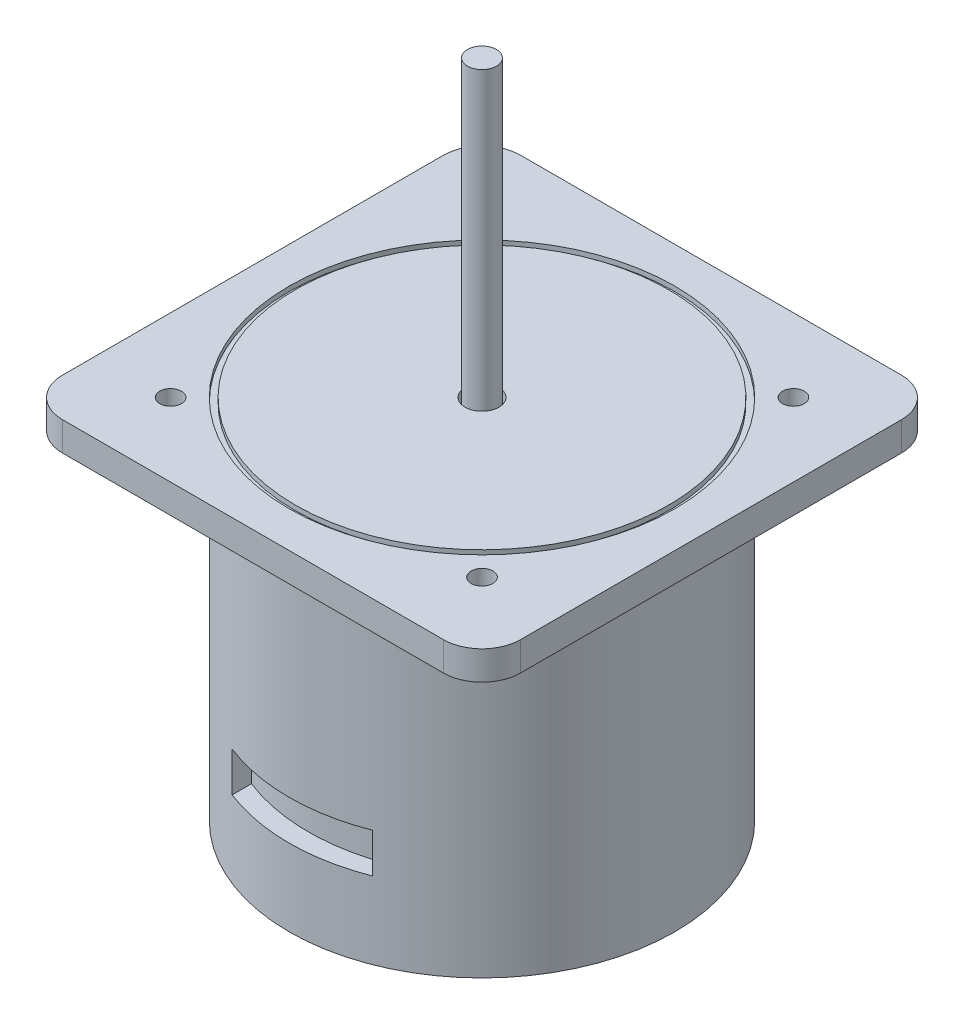
ISO-10303-21;
HEADER;
FILE_DESCRIPTION(('STEP AP214'),'2;1');
FILE_NAME('part.step','',(''),(''),'','','');
FILE_SCHEMA(('AUTOMOTIVE_DESIGN { 1 0 10303 214 1 1 1 1 }'));
ENDSEC;
DATA;
#1=APPLICATION_CONTEXT('core data for automotive mechanical design processes');
#2=APPLICATION_PROTOCOL_DEFINITION('international standard','automotive_design',2000,#1);
#3=PRODUCT_CONTEXT('',#1,'mechanical');
#4=PRODUCT('Part','Part','',(#3));
#5=PRODUCT_RELATED_PRODUCT_CATEGORY('part','',(#4));
#6=PRODUCT_DEFINITION_FORMATION('','',#4);
#7=PRODUCT_DEFINITION_CONTEXT('part definition',#1,'design');
#8=PRODUCT_DEFINITION('design','',#6,#7);
#9=PRODUCT_DEFINITION_SHAPE('','',#8);
#10=(LENGTH_UNIT() NAMED_UNIT(*) SI_UNIT(.MILLI.,.METRE.));
#11=(NAMED_UNIT(*) PLANE_ANGLE_UNIT() SI_UNIT($,.RADIAN.));
#12=(NAMED_UNIT(*) SI_UNIT($,.STERADIAN.) SOLID_ANGLE_UNIT());
#13=UNCERTAINTY_MEASURE_WITH_UNIT(LENGTH_MEASURE(1.E-05),#10,'distance_accuracy_value','');
#14=(GEOMETRIC_REPRESENTATION_CONTEXT(3) GLOBAL_UNCERTAINTY_ASSIGNED_CONTEXT((#13)) GLOBAL_UNIT_ASSIGNED_CONTEXT((#10,
#11,#12)) REPRESENTATION_CONTEXT('',''));
#15=CARTESIAN_POINT('',(0.,0.,0.));
#16=DIRECTION('',(0.,0.,1.));
#17=DIRECTION('',(1.,0.,0.));
#18=AXIS2_PLACEMENT_3D('',#15,#16,#17);
#19=CARTESIAN_POINT('',(0.,0.,0.));
#20=DIRECTION('',(0.,1.,0.));
#21=DIRECTION('',(0.,0.,1.));
#22=AXIS2_PLACEMENT_3D('',#19,#20,#21);
#23=PLANE('',#22);
#24=CARTESIAN_POINT('',(22.4964510362882,0.,0.));
#25=DIRECTION('',(0.,1.,0.));
#26=DIRECTION('',(0.,0.,-1.));
#27=AXIS2_PLACEMENT_3D('',#24,#25,#26);
#28=CIRCLE('',#27,5.38478881187688);
#29=CARTESIAN_POINT('',(25.6226762505398,0.,-4.38436614099365));
#30=VERTEX_POINT('',#29);
#31=CARTESIAN_POINT('',(25.77290034815,0.,4.27326929356368));
#32=VERTEX_POINT('',#31);
#33=EDGE_CURVE('E205',#30,#32,#28,.F.);
#34=ORIENTED_EDGE('',*,*,#33,.T.);
#35=DIRECTION('',(0.608463846276613,0.,0.793581594906454));
#36=VECTOR('',#35,1.);
#37=CARTESIAN_POINT('',(14.1676292878415,0.,-10.862764792469));
#38=LINE('',#37,#36);
#39=CARTESIAN_POINT('',(27.3190931834106,0.,6.28987255396704));
#40=VERTEX_POINT('',#39);
#41=EDGE_CURVE('E179',#32,#40,#38,.T.);
#42=ORIENTED_EDGE('',*,*,#41,.T.);
#43=CARTESIAN_POINT('',(22.4964510362882,0.,0.));
#44=DIRECTION('',(0.,1.,0.));
#45=DIRECTION('',(0.,0.,-1.));
#46=AXIS2_PLACEMENT_3D('',#43,#44,#45);
#47=CIRCLE('',#46,7.92593048318929);
#48=CARTESIAN_POINT('',(27.0979766649814,0.,-6.45339723810865));
#49=VERTEX_POINT('',#48);
#50=EDGE_CURVE('E193',#40,#49,#47,.T.);
#51=ORIENTED_EDGE('',*,*,#50,.T.);
#52=DIRECTION('',(0.58056598382398,0.,-0.814213202070867));
#53=VECTOR('',#52,1.);
#54=CARTESIAN_POINT('',(14.9138678534548,0.,10.634173384735));
#55=LINE('',#54,#53);
#56=EDGE_CURVE('E51',#30,#49,#55,.T.);
#57=ORIENTED_EDGE('',*,*,#56,.F.);
#58=EDGE_LOOP('',(#34,#42,#51,#57));
#59=FACE_BOUND('',#58,.T.);
#60=CARTESIAN_POINT('',(0.,0.,0.));
#61=DIRECTION('',(0.,1.,0.));
#62=DIRECTION('',(0.,0.,1.));
#63=AXIS2_PLACEMENT_3D('',#60,#61,#62);
#64=CIRCLE('',#63,40.);
#65=CARTESIAN_POINT('',(0.,0.,40.));
#66=VERTEX_POINT('',#65);
#67=EDGE_CURVE('E313',#66,#66,#64,.T.);
#68=ORIENTED_EDGE('',*,*,#67,.F.);
#69=EDGE_LOOP('',(#68));
#70=FACE_BOUND('',#69,.T.);
#71=DIRECTION('',(-0.608463846276613,0.,0.793581594906454));
#72=VECTOR('',#71,1.);
#73=CARTESIAN_POINT('',(-14.1676292878415,0.,-10.862764792469));
#74=LINE('',#73,#72);
#75=CARTESIAN_POINT('',(-25.77290034815,0.,4.27326929356368));
#76=VERTEX_POINT('',#75);
#77=CARTESIAN_POINT('',(-27.3190931834106,0.,6.28987255396704));
#78=VERTEX_POINT('',#77);
#79=EDGE_CURVE('E184',#76,#78,#74,.T.);
#80=ORIENTED_EDGE('',*,*,#79,.F.);
#81=CARTESIAN_POINT('',(-22.4964510362882,0.,0.));
#82=DIRECTION('',(0.,-1.,0.));
#83=DIRECTION('',(0.,0.,-1.));
#84=AXIS2_PLACEMENT_3D('',#81,#82,#83);
#85=CIRCLE('',#84,5.38478881187688);
#86=CARTESIAN_POINT('',(-25.6226762505398,0.,-4.38436614099365));
#87=VERTEX_POINT('',#86);
#88=EDGE_CURVE('E218',#87,#76,#85,.F.);
#89=ORIENTED_EDGE('',*,*,#88,.F.);
#90=DIRECTION('',(-0.58056598382398,0.,-0.814213202070867));
#91=VECTOR('',#90,1.);
#92=CARTESIAN_POINT('',(-14.9138678534548,0.,10.634173384735));
#93=LINE('',#92,#91);
#94=CARTESIAN_POINT('',(-27.0979766649814,0.,-6.45339723810865));
#95=VERTEX_POINT('',#94);
#96=EDGE_CURVE('E229',#87,#95,#93,.T.);
#97=ORIENTED_EDGE('',*,*,#96,.T.);
#98=CARTESIAN_POINT('',(-22.4964510362882,0.,0.));
#99=DIRECTION('',(0.,-1.,0.));
#100=DIRECTION('',(0.,0.,-1.));
#101=AXIS2_PLACEMENT_3D('',#98,#99,#100);
#102=CIRCLE('',#101,7.92593048318929);
#103=EDGE_CURVE('E59',#78,#95,#102,.T.);
#104=ORIENTED_EDGE('',*,*,#103,.F.);
#105=EDGE_LOOP('',(#80,#89,#97,#104));
#106=FACE_BOUND('',#105,.T.);
#107=ADVANCED_FACE('F34',(#59,#70,#106),#23,.F.);
#108=CARTESIAN_POINT('',(0.,70.,0.));
#109=DIRECTION('',(0.,-1.,0.));
#110=DIRECTION('',(0.,0.,-1.));
#111=AXIS2_PLACEMENT_3D('',#108,#109,#110);
#112=CYLINDRICAL_SURFACE('',#111,40.);
#113=ORIENTED_EDGE('',*,*,#67,.T.);
#114=EDGE_LOOP('',(#113));
#115=FACE_BOUND('',#114,.T.);
#116=CARTESIAN_POINT('',(0.,70.,0.));
#117=DIRECTION('',(0.,1.,0.));
#118=DIRECTION('',(0.,0.,1.));
#119=AXIS2_PLACEMENT_3D('',#116,#117,#118);
#120=CIRCLE('',#119,40.);
#121=CARTESIAN_POINT('',(0.,70.,40.));
#122=VERTEX_POINT('',#121);
#123=EDGE_CURVE('E324',#122,#122,#120,.T.);
#124=ORIENTED_EDGE('',*,*,#123,.F.);
#125=EDGE_LOOP('',(#124));
#126=FACE_BOUND('',#125,.T.);
#127=DIRECTION('',(0.,-1.,0.));
#128=VECTOR('',#127,1.);
#129=CARTESIAN_POINT('',(-14.5735687844263,70.,37.2506522477875));
#130=LINE('',#129,#128);
#131=CARTESIAN_POINT('',(-14.5735687844263,24.166302971847,37.2506522477875));
#132=VERTEX_POINT('',#131);
#133=CARTESIAN_POINT('',(-14.5735687844263,15.945315452427,37.2506522477875));
#134=VERTEX_POINT('',#133);
#135=EDGE_CURVE('E257',#132,#134,#130,.T.);
#136=ORIENTED_EDGE('',*,*,#135,.F.);
#137=CARTESIAN_POINT('',(0.,24.166302971847,0.));
#138=DIRECTION('',(0.,-1.,0.));
#139=DIRECTION('',(0.,0.,-1.));
#140=AXIS2_PLACEMENT_3D('',#137,#138,#139);
#141=CIRCLE('',#140,40.);
#142=CARTESIAN_POINT('',(14.5735687844263,24.166302971847,37.2506522477875));
#143=VERTEX_POINT('',#142);
#144=EDGE_CURVE('E253',#143,#132,#141,.T.);
#145=ORIENTED_EDGE('',*,*,#144,.F.);
#146=DIRECTION('',(0.,-1.,0.));
#147=VECTOR('',#146,1.);
#148=CARTESIAN_POINT('',(14.5735687844263,70.,37.2506522477875));
#149=LINE('',#148,#147);
#150=CARTESIAN_POINT('',(14.5735687844263,15.945315452427,37.2506522477875));
#151=VERTEX_POINT('',#150);
#152=EDGE_CURVE('E248',#143,#151,#149,.T.);
#153=ORIENTED_EDGE('',*,*,#152,.T.);
#154=CARTESIAN_POINT('',(0.,15.945315452427,0.));
#155=DIRECTION('',(0.,1.,0.));
#156=DIRECTION('',(0.,0.,1.));
#157=AXIS2_PLACEMENT_3D('',#154,#155,#156);
#158=CIRCLE('',#157,40.);
#159=EDGE_CURVE('E244',#134,#151,#158,.T.);
#160=ORIENTED_EDGE('',*,*,#159,.F.);
#161=EDGE_LOOP('',(#136,#145,#153,#160));
#162=FACE_BOUND('',#161,.T.);
#163=ADVANCED_FACE('F391',(#115,#126,#162),#112,.T.);
#164=CARTESIAN_POINT('',(47.5,76.,-47.5));
#165=DIRECTION('',(-1.,0.,0.));
#166=DIRECTION('',(0.,0.,1.));
#167=AXIS2_PLACEMENT_3D('',#164,#165,#166);
#168=PLANE('',#167);
#169=DIRECTION('',(0.,0.,-1.));
#170=VECTOR('',#169,1.);
#171=CARTESIAN_POINT('',(47.5,76.,-47.5));
#172=LINE('',#171,#170);
#173=CARTESIAN_POINT('',(47.5,76.,39.5));
#174=VERTEX_POINT('',#173);
#175=CARTESIAN_POINT('',(47.5,76.,-39.5));
#176=VERTEX_POINT('',#175);
#177=EDGE_CURVE('E300',#174,#176,#172,.T.);
#178=ORIENTED_EDGE('',*,*,#177,.F.);
#179=DIRECTION('',(0.,-1.,0.));
#180=VECTOR('',#179,1.);
#181=CARTESIAN_POINT('',(47.5,76.,39.5));
#182=LINE('',#181,#180);
#183=CARTESIAN_POINT('',(47.5,70.,39.5));
#184=VERTEX_POINT('',#183);
#185=EDGE_CURVE('E331',#174,#184,#182,.T.);
#186=ORIENTED_EDGE('',*,*,#185,.T.);
#187=DIRECTION('',(0.,0.,-1.));
#188=VECTOR('',#187,1.);
#189=CARTESIAN_POINT('',(47.5,70.,-47.5));
#190=LINE('',#189,#188);
#191=CARTESIAN_POINT('',(47.5,70.,-39.5));
#192=VERTEX_POINT('',#191);
#193=EDGE_CURVE('E297',#184,#192,#190,.T.);
#194=ORIENTED_EDGE('',*,*,#193,.T.);
#195=DIRECTION('',(0.,-1.,0.));
#196=VECTOR('',#195,1.);
#197=CARTESIAN_POINT('',(47.5,76.,-39.5));
#198=LINE('',#197,#196);
#199=EDGE_CURVE('E327',#192,#176,#198,.F.);
#200=ORIENTED_EDGE('',*,*,#199,.T.);
#201=EDGE_LOOP('',(#178,#186,#194,#200));
#202=FACE_BOUND('',#201,.T.);
#203=ADVANCED_FACE('F397',(#202),#168,.F.);
#204=CARTESIAN_POINT('',(-47.5,76.,-47.5));
#205=DIRECTION('',(0.,0.,1.));
#206=DIRECTION('',(1.,0.,0.));
#207=AXIS2_PLACEMENT_3D('',#204,#205,#206);
#208=PLANE('',#207);
#209=DIRECTION('',(-1.,0.,0.));
#210=VECTOR('',#209,1.);
#211=CARTESIAN_POINT('',(-47.5,70.,-47.5));
#212=LINE('',#211,#210);
#213=CARTESIAN_POINT('',(39.5,70.,-47.5));
#214=VERTEX_POINT('',#213);
#215=CARTESIAN_POINT('',(-39.5,70.,-47.5));
#216=VERTEX_POINT('',#215);
#217=EDGE_CURVE('E316',#214,#216,#212,.T.);
#218=ORIENTED_EDGE('',*,*,#217,.T.);
#219=DIRECTION('',(0.,-1.,0.));
#220=VECTOR('',#219,1.);
#221=CARTESIAN_POINT('',(-39.5,76.,-47.5));
#222=LINE('',#221,#220);
#223=CARTESIAN_POINT('',(-39.5,76.,-47.5));
#224=VERTEX_POINT('',#223);
#225=EDGE_CURVE('E11',#216,#224,#222,.F.);
#226=ORIENTED_EDGE('',*,*,#225,.T.);
#227=DIRECTION('',(-1.,0.,0.));
#228=VECTOR('',#227,1.);
#229=CARTESIAN_POINT('',(-47.5,76.,-47.5));
#230=LINE('',#229,#228);
#231=CARTESIAN_POINT('',(39.5,76.,-47.5));
#232=VERTEX_POINT('',#231);
#233=EDGE_CURVE('E303',#232,#224,#230,.T.);
#234=ORIENTED_EDGE('',*,*,#233,.F.);
#235=DIRECTION('',(0.,-1.,0.));
#236=VECTOR('',#235,1.);
#237=CARTESIAN_POINT('',(39.5,76.,-47.5));
#238=LINE('',#237,#236);
#239=EDGE_CURVE('E43',#232,#214,#238,.T.);
#240=ORIENTED_EDGE('',*,*,#239,.T.);
#241=EDGE_LOOP('',(#218,#226,#234,#240));
#242=FACE_BOUND('',#241,.T.);
#243=ADVANCED_FACE('F447',(#242),#208,.F.);
#244=CARTESIAN_POINT('',(-47.5,76.,-47.5));
#245=DIRECTION('',(1.,0.,0.));
#246=DIRECTION('',(0.,0.,-1.));
#247=AXIS2_PLACEMENT_3D('',#244,#245,#246);
#248=PLANE('',#247);
#249=DIRECTION('',(0.,0.,1.));
#250=VECTOR('',#249,1.);
#251=CARTESIAN_POINT('',(-47.5,70.,-47.5));
#252=LINE('',#251,#250);
#253=CARTESIAN_POINT('',(-47.5,70.,-39.5));
#254=VERTEX_POINT('',#253);
#255=CARTESIAN_POINT('',(-47.5,70.,39.5));
#256=VERTEX_POINT('',#255);
#257=EDGE_CURVE('E319',#254,#256,#252,.T.);
#258=ORIENTED_EDGE('',*,*,#257,.T.);
#259=DIRECTION('',(0.,-1.,0.));
#260=VECTOR('',#259,1.);
#261=CARTESIAN_POINT('',(-47.5,76.,39.5));
#262=LINE('',#261,#260);
#263=CARTESIAN_POINT('',(-47.5,76.,39.5));
#264=VERTEX_POINT('',#263);
#265=EDGE_CURVE('E358',#256,#264,#262,.F.);
#266=ORIENTED_EDGE('',*,*,#265,.T.);
#267=DIRECTION('',(0.,0.,1.));
#268=VECTOR('',#267,1.);
#269=CARTESIAN_POINT('',(-47.5,76.,-47.5));
#270=LINE('',#269,#268);
#271=CARTESIAN_POINT('',(-47.5,76.,-39.5));
#272=VERTEX_POINT('',#271);
#273=EDGE_CURVE('E307',#272,#264,#270,.T.);
#274=ORIENTED_EDGE('',*,*,#273,.F.);
#275=DIRECTION('',(0.,-1.,0.));
#276=VECTOR('',#275,1.);
#277=CARTESIAN_POINT('',(-47.5,76.,-39.5));
#278=LINE('',#277,#276);
#279=EDGE_CURVE('E355',#272,#254,#278,.T.);
#280=ORIENTED_EDGE('',*,*,#279,.T.);
#281=EDGE_LOOP('',(#258,#266,#274,#280));
#282=FACE_BOUND('',#281,.T.);
#283=ADVANCED_FACE('F429',(#282),#248,.F.);
#284=CARTESIAN_POINT('',(-47.5,76.,47.5));
#285=DIRECTION('',(0.,0.,-1.));
#286=DIRECTION('',(-1.,0.,0.));
#287=AXIS2_PLACEMENT_3D('',#284,#285,#286);
#288=PLANE('',#287);
#289=DIRECTION('',(1.,0.,0.));
#290=VECTOR('',#289,1.);
#291=CARTESIAN_POINT('',(-47.5,70.,47.5));
#292=LINE('',#291,#290);
#293=CARTESIAN_POINT('',(-39.5,70.,47.5));
#294=VERTEX_POINT('',#293);
#295=CARTESIAN_POINT('',(39.5,70.,47.5));
#296=VERTEX_POINT('',#295);
#297=EDGE_CURVE('E304',#294,#296,#292,.T.);
#298=ORIENTED_EDGE('',*,*,#297,.T.);
#299=DIRECTION('',(0.,-1.,0.));
#300=VECTOR('',#299,1.);
#301=CARTESIAN_POINT('',(39.5,76.,47.5));
#302=LINE('',#301,#300);
#303=CARTESIAN_POINT('',(39.5,76.,47.5));
#304=VERTEX_POINT('',#303);
#305=EDGE_CURVE('E345',#296,#304,#302,.F.);
#306=ORIENTED_EDGE('',*,*,#305,.T.);
#307=DIRECTION('',(1.,0.,0.));
#308=VECTOR('',#307,1.);
#309=CARTESIAN_POINT('',(-47.5,76.,47.5));
#310=LINE('',#309,#308);
#311=CARTESIAN_POINT('',(-39.5,76.,47.5));
#312=VERTEX_POINT('',#311);
#313=EDGE_CURVE('E310',#312,#304,#310,.T.);
#314=ORIENTED_EDGE('',*,*,#313,.F.);
#315=DIRECTION('',(0.,-1.,0.));
#316=VECTOR('',#315,1.);
#317=CARTESIAN_POINT('',(-39.5,76.,47.5));
#318=LINE('',#317,#316);
#319=EDGE_CURVE('E342',#312,#294,#318,.T.);
#320=ORIENTED_EDGE('',*,*,#319,.T.);
#321=EDGE_LOOP('',(#298,#306,#314,#320));
#322=FACE_BOUND('',#321,.T.);
#323=ADVANCED_FACE('F436',(#322),#288,.F.);
#324=CARTESIAN_POINT('',(0.,76.,0.));
#325=DIRECTION('',(0.,1.,0.));
#326=DIRECTION('',(0.,0.,1.));
#327=AXIS2_PLACEMENT_3D('',#324,#325,#326);
#328=PLANE('',#327);
#329=CARTESIAN_POINT('',(-32.2955996908533,76.,32.2955996908551));
#330=DIRECTION('',(0.,1.,0.));
#331=DIRECTION('',(0.,0.,1.));
#332=AXIS2_PLACEMENT_3D('',#329,#330,#331);
#333=CIRCLE('',#332,2.25);
#334=CARTESIAN_POINT('',(-32.2955996908533,76.,34.5455996908551));
#335=VERTEX_POINT('',#334);
#336=EDGE_CURVE('E702',#335,#335,#333,.T.);
#337=ORIENTED_EDGE('',*,*,#336,.F.);
#338=EDGE_LOOP('',(#337));
#339=FACE_BOUND('',#338,.T.);
#340=CARTESIAN_POINT('',(32.295599690857,76.,32.2955996908533));
#341=DIRECTION('',(0.,1.,0.));
#342=DIRECTION('',(0.,0.,1.));
#343=AXIS2_PLACEMENT_3D('',#340,#341,#342);
#344=CIRCLE('',#343,2.25);
#345=CARTESIAN_POINT('',(32.295599690857,76.,34.5455996908533));
#346=VERTEX_POINT('',#345);
#347=EDGE_CURVE('E698',#346,#346,#344,.T.);
#348=ORIENTED_EDGE('',*,*,#347,.F.);
#349=EDGE_LOOP('',(#348));
#350=FACE_BOUND('',#349,.T.);
#351=CARTESIAN_POINT('',(32.2955996908551,76.,-32.295599690857));
#352=DIRECTION('',(0.,1.,0.));
#353=DIRECTION('',(0.,0.,1.));
#354=AXIS2_PLACEMENT_3D('',#351,#352,#353);
#355=CIRCLE('',#354,2.25);
#356=CARTESIAN_POINT('',(32.2955996908551,76.,-30.045599690857));
#357=VERTEX_POINT('',#356);
#358=EDGE_CURVE('E679',#357,#357,#355,.T.);
#359=ORIENTED_EDGE('',*,*,#358,.F.);
#360=EDGE_LOOP('',(#359));
#361=FACE_BOUND('',#360,.T.);
#362=CARTESIAN_POINT('',(-32.2955996908551,76.,-32.2955996908551));
#363=DIRECTION('',(0.,1.,0.));
#364=DIRECTION('',(0.,0.,1.));
#365=AXIS2_PLACEMENT_3D('',#362,#363,#364);
#366=CIRCLE('',#365,2.25);
#367=CARTESIAN_POINT('',(-32.2955996908551,76.,-30.0455996908551));
#368=VERTEX_POINT('',#367);
#369=EDGE_CURVE('E366',#368,#368,#366,.T.);
#370=ORIENTED_EDGE('',*,*,#369,.F.);
#371=EDGE_LOOP('',(#370));
#372=FACE_BOUND('',#371,.T.);
#373=CARTESIAN_POINT('',(0.,76.,0.));
#374=DIRECTION('',(0.,1.,0.));
#375=DIRECTION('',(0.,0.,1.));
#376=AXIS2_PLACEMENT_3D('',#373,#374,#375);
#377=CIRCLE('',#376,40.);
#378=CARTESIAN_POINT('',(0.,76.,40.));
#379=VERTEX_POINT('',#378);
#380=EDGE_CURVE('E291',#379,#379,#377,.T.);
#381=ORIENTED_EDGE('',*,*,#380,.F.);
#382=EDGE_LOOP('',(#381));
#383=FACE_BOUND('',#382,.T.);
#384=ORIENTED_EDGE('',*,*,#313,.T.);
#385=CARTESIAN_POINT('',(39.5,76.,39.5));
#386=DIRECTION('',(0.,1.,0.));
#387=DIRECTION('',(0.,0.,1.));
#388=AXIS2_PLACEMENT_3D('',#385,#386,#387);
#389=CIRCLE('',#388,8.);
#390=EDGE_CURVE('E353',#304,#174,#389,.T.);
#391=ORIENTED_EDGE('',*,*,#390,.T.);
#392=ORIENTED_EDGE('',*,*,#177,.T.);
#393=CARTESIAN_POINT('',(39.5,76.,-39.5));
#394=DIRECTION('',(0.,1.,0.));
#395=DIRECTION('',(0.,0.,1.));
#396=AXIS2_PLACEMENT_3D('',#393,#394,#395);
#397=CIRCLE('',#396,8.);
#398=EDGE_CURVE('E347',#176,#232,#397,.T.);
#399=ORIENTED_EDGE('',*,*,#398,.T.);
#400=ORIENTED_EDGE('',*,*,#233,.T.);
#401=CARTESIAN_POINT('',(-39.5,76.,-39.5));
#402=DIRECTION('',(0.,1.,0.));
#403=DIRECTION('',(0.,0.,1.));
#404=AXIS2_PLACEMENT_3D('',#401,#402,#403);
#405=CIRCLE('',#404,8.);
#406=EDGE_CURVE('E349',#224,#272,#405,.T.);
#407=ORIENTED_EDGE('',*,*,#406,.T.);
#408=ORIENTED_EDGE('',*,*,#273,.T.);
#409=CARTESIAN_POINT('',(-39.5,76.,39.5));
#410=DIRECTION('',(0.,1.,0.));
#411=DIRECTION('',(0.,0.,1.));
#412=AXIS2_PLACEMENT_3D('',#409,#410,#411);
#413=CIRCLE('',#412,8.);
#414=EDGE_CURVE('E351',#264,#312,#413,.T.);
#415=ORIENTED_EDGE('',*,*,#414,.T.);
#416=EDGE_LOOP('',(#384,#391,#392,#399,#400,#407,#408,#415));
#417=FACE_BOUND('',#416,.T.);
#418=ADVANCED_FACE('F425',(#339,#350,#361,#372,#383,#417),#328,.T.);
#419=CARTESIAN_POINT('',(0.,70.,0.));
#420=DIRECTION('',(0.,1.,0.));
#421=DIRECTION('',(0.,0.,1.));
#422=AXIS2_PLACEMENT_3D('',#419,#420,#421);
#423=PLANE('',#422);
#424=CARTESIAN_POINT('',(-32.2955996908533,70.,32.2955996908551));
#425=DIRECTION('',(0.,1.,0.));
#426=DIRECTION('',(0.,0.,1.));
#427=AXIS2_PLACEMENT_3D('',#424,#425,#426);
#428=CIRCLE('',#427,2.25);
#429=CARTESIAN_POINT('',(-32.2955996908533,70.,34.5455996908551));
#430=VERTEX_POINT('',#429);
#431=EDGE_CURVE('E38',#430,#430,#428,.T.);
#432=ORIENTED_EDGE('',*,*,#431,.T.);
#433=EDGE_LOOP('',(#432));
#434=FACE_BOUND('',#433,.T.);
#435=CARTESIAN_POINT('',(32.295599690857,70.,32.2955996908533));
#436=DIRECTION('',(0.,1.,0.));
#437=DIRECTION('',(0.,0.,1.));
#438=AXIS2_PLACEMENT_3D('',#435,#436,#437);
#439=CIRCLE('',#438,2.25);
#440=CARTESIAN_POINT('',(32.295599690857,70.,34.5455996908533));
#441=VERTEX_POINT('',#440);
#442=EDGE_CURVE('E368',#441,#441,#439,.T.);
#443=ORIENTED_EDGE('',*,*,#442,.T.);
#444=EDGE_LOOP('',(#443));
#445=FACE_BOUND('',#444,.T.);
#446=CARTESIAN_POINT('',(32.2955996908551,70.,-32.295599690857));
#447=DIRECTION('',(0.,1.,0.));
#448=DIRECTION('',(0.,0.,1.));
#449=AXIS2_PLACEMENT_3D('',#446,#447,#448);
#450=CIRCLE('',#449,2.25);
#451=CARTESIAN_POINT('',(32.2955996908551,70.,-30.045599690857));
#452=VERTEX_POINT('',#451);
#453=EDGE_CURVE('E365',#452,#452,#450,.T.);
#454=ORIENTED_EDGE('',*,*,#453,.T.);
#455=EDGE_LOOP('',(#454));
#456=FACE_BOUND('',#455,.T.);
#457=CARTESIAN_POINT('',(-32.2955996908551,70.,-32.2955996908551));
#458=DIRECTION('',(0.,1.,0.));
#459=DIRECTION('',(0.,0.,1.));
#460=AXIS2_PLACEMENT_3D('',#457,#458,#459);
#461=CIRCLE('',#460,2.25);
#462=CARTESIAN_POINT('',(-32.2955996908551,70.,-30.0455996908551));
#463=VERTEX_POINT('',#462);
#464=EDGE_CURVE('E362',#463,#463,#461,.T.);
#465=ORIENTED_EDGE('',*,*,#464,.T.);
#466=EDGE_LOOP('',(#465));
#467=FACE_BOUND('',#466,.T.);
#468=ORIENTED_EDGE('',*,*,#123,.T.);
#469=EDGE_LOOP('',(#468));
#470=FACE_BOUND('',#469,.T.);
#471=ORIENTED_EDGE('',*,*,#193,.F.);
#472=CARTESIAN_POINT('',(39.5,70.,39.5));
#473=DIRECTION('',(0.,1.,0.));
#474=DIRECTION('',(0.,0.,1.));
#475=AXIS2_PLACEMENT_3D('',#472,#473,#474);
#476=CIRCLE('',#475,8.);
#477=EDGE_CURVE('E340',#184,#296,#476,.F.);
#478=ORIENTED_EDGE('',*,*,#477,.T.);
#479=ORIENTED_EDGE('',*,*,#297,.F.);
#480=CARTESIAN_POINT('',(-39.5,70.,39.5));
#481=DIRECTION('',(0.,1.,0.));
#482=DIRECTION('',(0.,0.,1.));
#483=AXIS2_PLACEMENT_3D('',#480,#481,#482);
#484=CIRCLE('',#483,8.);
#485=EDGE_CURVE('E338',#294,#256,#484,.F.);
#486=ORIENTED_EDGE('',*,*,#485,.T.);
#487=ORIENTED_EDGE('',*,*,#257,.F.);
#488=CARTESIAN_POINT('',(-39.5,70.,-39.5));
#489=DIRECTION('',(0.,1.,0.));
#490=DIRECTION('',(0.,0.,1.));
#491=AXIS2_PLACEMENT_3D('',#488,#489,#490);
#492=CIRCLE('',#491,8.);
#493=EDGE_CURVE('E336',#254,#216,#492,.F.);
#494=ORIENTED_EDGE('',*,*,#493,.T.);
#495=ORIENTED_EDGE('',*,*,#217,.F.);
#496=CARTESIAN_POINT('',(39.5,70.,-39.5));
#497=DIRECTION('',(0.,1.,0.));
#498=DIRECTION('',(0.,0.,1.));
#499=AXIS2_PLACEMENT_3D('',#496,#497,#498);
#500=CIRCLE('',#499,8.);
#501=EDGE_CURVE('E334',#214,#192,#500,.F.);
#502=ORIENTED_EDGE('',*,*,#501,.T.);
#503=EDGE_LOOP('',(#471,#478,#479,#486,#487,#494,#495,#502));
#504=FACE_BOUND('',#503,.T.);
#505=ADVANCED_FACE('F375',(#434,#445,#456,#467,#470,#504),#423,.F.);
#506=CARTESIAN_POINT('',(0.,75.,0.));
#507=DIRECTION('',(0.,1.,0.));
#508=DIRECTION('',(0.,0.,1.));
#509=AXIS2_PLACEMENT_3D('',#506,#507,#508);
#510=CYLINDRICAL_SURFACE('',#509,40.);
#511=CARTESIAN_POINT('',(0.,75.,0.));
#512=DIRECTION('',(0.,1.,0.));
#513=DIRECTION('',(0.,0.,1.));
#514=AXIS2_PLACEMENT_3D('',#511,#512,#513);
#515=CIRCLE('',#514,40.);
#516=CARTESIAN_POINT('',(0.,75.,40.));
#517=VERTEX_POINT('',#516);
#518=EDGE_CURVE('E294',#517,#517,#515,.T.);
#519=ORIENTED_EDGE('',*,*,#518,.F.);
#520=EDGE_LOOP('',(#519));
#521=FACE_BOUND('',#520,.T.);
#522=ORIENTED_EDGE('',*,*,#380,.T.);
#523=EDGE_LOOP('',(#522));
#524=FACE_BOUND('',#523,.T.);
#525=ADVANCED_FACE('F451',(#521,#524),#510,.F.);
#526=CARTESIAN_POINT('',(0.,75.,0.));
#527=DIRECTION('',(0.,1.,0.));
#528=DIRECTION('',(0.,0.,1.));
#529=AXIS2_PLACEMENT_3D('',#526,#527,#528);
#530=PLANE('',#529);
#531=CARTESIAN_POINT('',(0.,75.,0.));
#532=DIRECTION('',(0.,1.,0.));
#533=DIRECTION('',(0.,0.,1.));
#534=AXIS2_PLACEMENT_3D('',#531,#532,#533);
#535=CIRCLE('',#534,38.7092730320655);
#536=CARTESIAN_POINT('',(0.,75.,38.7092730320655));
#537=VERTEX_POINT('',#536);
#538=EDGE_CURVE('E288',#537,#537,#535,.T.);
#539=ORIENTED_EDGE('',*,*,#538,.F.);
#540=EDGE_LOOP('',(#539));
#541=FACE_BOUND('',#540,.T.);
#542=ORIENTED_EDGE('',*,*,#518,.T.);
#543=EDGE_LOOP('',(#542));
#544=FACE_BOUND('',#543,.T.);
#545=ADVANCED_FACE('F457',(#541,#544),#530,.T.);
#546=CARTESIAN_POINT('',(0.,75.,0.));
#547=DIRECTION('',(0.,1.,0.));
#548=DIRECTION('',(0.,0.,1.));
#549=AXIS2_PLACEMENT_3D('',#546,#547,#548);
#550=CYLINDRICAL_SURFACE('',#549,38.7092730320655);
#551=ORIENTED_EDGE('',*,*,#538,.T.);
#552=EDGE_LOOP('',(#551));
#553=FACE_BOUND('',#552,.T.);
#554=CARTESIAN_POINT('',(0.,76.,0.));
#555=DIRECTION('',(0.,1.,0.));
#556=DIRECTION('',(0.,0.,1.));
#557=AXIS2_PLACEMENT_3D('',#554,#555,#556);
#558=CIRCLE('',#557,38.7092730320655);
#559=CARTESIAN_POINT('',(0.,76.,38.7092730320655));
#560=VERTEX_POINT('',#559);
#561=EDGE_CURVE('E287',#560,#560,#558,.T.);
#562=ORIENTED_EDGE('',*,*,#561,.F.);
#563=EDGE_LOOP('',(#562));
#564=FACE_BOUND('',#563,.T.);
#565=ADVANCED_FACE('F728',(#553,#564),#550,.T.);
#566=CARTESIAN_POINT('',(0.,76.,0.));
#567=DIRECTION('',(0.,1.,0.));
#568=DIRECTION('',(0.,0.,1.));
#569=AXIS2_PLACEMENT_3D('',#566,#567,#568);
#570=CIRCLE('',#569,3.51956070686339);
#571=CARTESIAN_POINT('',(0.,76.,3.51956070686339));
#572=VERTEX_POINT('',#571);
#573=EDGE_CURVE('E278',#572,#572,#570,.T.);
#574=ORIENTED_EDGE('',*,*,#573,.F.);
#575=EDGE_LOOP('',(#574));
#576=FACE_BOUND('',#575,.T.);
#577=ORIENTED_EDGE('',*,*,#561,.T.);
#578=EDGE_LOOP('',(#577));
#579=FACE_BOUND('',#578,.T.);
#580=ADVANCED_FACE('F408',(#576,#579),#328,.T.);
#581=CARTESIAN_POINT('',(39.5,76.,39.5));
#582=DIRECTION('',(0.,-1.,0.));
#583=DIRECTION('',(0.,0.,-1.));
#584=AXIS2_PLACEMENT_3D('',#581,#582,#583);
#585=CYLINDRICAL_SURFACE('',#584,8.);
#586=ORIENTED_EDGE('',*,*,#390,.F.);
#587=ORIENTED_EDGE('',*,*,#305,.F.);
#588=ORIENTED_EDGE('',*,*,#477,.F.);
#589=ORIENTED_EDGE('',*,*,#185,.F.);
#590=EDGE_LOOP('',(#586,#587,#588,#589));
#591=FACE_BOUND('',#590,.T.);
#592=ADVANCED_FACE('F404',(#591),#585,.T.);
#593=CARTESIAN_POINT('',(-39.5,76.,39.5));
#594=DIRECTION('',(0.,-1.,0.));
#595=DIRECTION('',(0.,0.,-1.));
#596=AXIS2_PLACEMENT_3D('',#593,#594,#595);
#597=CYLINDRICAL_SURFACE('',#596,8.);
#598=ORIENTED_EDGE('',*,*,#414,.F.);
#599=ORIENTED_EDGE('',*,*,#265,.F.);
#600=ORIENTED_EDGE('',*,*,#485,.F.);
#601=ORIENTED_EDGE('',*,*,#319,.F.);
#602=EDGE_LOOP('',(#598,#599,#600,#601));
#603=FACE_BOUND('',#602,.T.);
#604=ADVANCED_FACE('F407',(#603),#597,.T.);
#605=CARTESIAN_POINT('',(-39.5,76.,-39.5));
#606=DIRECTION('',(0.,-1.,0.));
#607=DIRECTION('',(0.,0.,-1.));
#608=AXIS2_PLACEMENT_3D('',#605,#606,#607);
#609=CYLINDRICAL_SURFACE('',#608,8.);
#610=ORIENTED_EDGE('',*,*,#406,.F.);
#611=ORIENTED_EDGE('',*,*,#225,.F.);
#612=ORIENTED_EDGE('',*,*,#493,.F.);
#613=ORIENTED_EDGE('',*,*,#279,.F.);
#614=EDGE_LOOP('',(#610,#611,#612,#613));
#615=FACE_BOUND('',#614,.T.);
#616=ADVANCED_FACE('F411',(#615),#609,.T.);
#617=CARTESIAN_POINT('',(39.5,76.,-39.5));
#618=DIRECTION('',(0.,-1.,0.));
#619=DIRECTION('',(0.,0.,-1.));
#620=AXIS2_PLACEMENT_3D('',#617,#618,#619);
#621=CYLINDRICAL_SURFACE('',#620,8.);
#622=ORIENTED_EDGE('',*,*,#398,.F.);
#623=ORIENTED_EDGE('',*,*,#199,.F.);
#624=ORIENTED_EDGE('',*,*,#501,.F.);
#625=ORIENTED_EDGE('',*,*,#239,.F.);
#626=EDGE_LOOP('',(#622,#623,#624,#625));
#627=FACE_BOUND('',#626,.T.);
#628=ADVANCED_FACE('F36',(#627),#621,.T.);
#629=CARTESIAN_POINT('',(0.,71.,0.));
#630=DIRECTION('',(0.,1.,0.));
#631=DIRECTION('',(0.,0.,1.));
#632=AXIS2_PLACEMENT_3D('',#629,#630,#631);
#633=CYLINDRICAL_SURFACE('',#632,3.51956070686339);
#634=CARTESIAN_POINT('',(0.,71.,0.));
#635=DIRECTION('',(0.,1.,0.));
#636=DIRECTION('',(0.,0.,1.));
#637=AXIS2_PLACEMENT_3D('',#634,#635,#636);
#638=CIRCLE('',#637,3.51956070686339);
#639=CARTESIAN_POINT('',(0.,71.,3.51956070686339));
#640=VERTEX_POINT('',#639);
#641=EDGE_CURVE('E279',#640,#640,#638,.T.);
#642=ORIENTED_EDGE('',*,*,#641,.F.);
#643=EDGE_LOOP('',(#642));
#644=FACE_BOUND('',#643,.T.);
#645=ORIENTED_EDGE('',*,*,#573,.T.);
#646=EDGE_LOOP('',(#645));
#647=FACE_BOUND('',#646,.T.);
#648=ADVANCED_FACE('F418',(#644,#647),#633,.F.);
#649=CARTESIAN_POINT('',(0.,71.,0.));
#650=DIRECTION('',(0.,1.,0.));
#651=DIRECTION('',(0.,0.,1.));
#652=AXIS2_PLACEMENT_3D('',#649,#650,#651);
#653=PLANE('',#652);
#654=CARTESIAN_POINT('',(0.,71.,0.));
#655=DIRECTION('',(0.,1.,0.));
#656=DIRECTION('',(0.,0.,1.));
#657=AXIS2_PLACEMENT_3D('',#654,#655,#656);
#658=CIRCLE('',#657,3.);
#659=CARTESIAN_POINT('',(0.,71.,-3.));
#660=VERTEX_POINT('',#659);
#661=EDGE_CURVE('E246',#660,#660,#658,.T.);
#662=ORIENTED_EDGE('',*,*,#661,.F.);
#663=EDGE_LOOP('',(#662));
#664=FACE_BOUND('',#663,.T.);
#665=ORIENTED_EDGE('',*,*,#641,.T.);
#666=EDGE_LOOP('',(#665));
#667=FACE_BOUND('',#666,.T.);
#668=ADVANCED_FACE('F715',(#664,#667),#653,.T.);
#669=CARTESIAN_POINT('',(0.,137.,0.));
#670=DIRECTION('',(0.,1.,0.));
#671=DIRECTION('',(0.,0.,1.));
#672=AXIS2_PLACEMENT_3D('',#669,#670,#671);
#673=PLANE('',#672);
#674=CARTESIAN_POINT('',(0.,137.,0.));
#675=DIRECTION('',(0.,1.,0.));
#676=DIRECTION('',(0.,0.,1.));
#677=AXIS2_PLACEMENT_3D('',#674,#675,#676);
#678=CIRCLE('',#677,3.);
#679=CARTESIAN_POINT('',(0.,137.,-3.));
#680=VERTEX_POINT('',#679);
#681=EDGE_CURVE('E282',#680,#680,#678,.T.);
#682=ORIENTED_EDGE('',*,*,#681,.T.);
#683=EDGE_LOOP('',(#682));
#684=FACE_BOUND('',#683,.T.);
#685=ADVANCED_FACE('F718',(#684),#673,.T.);
#686=CARTESIAN_POINT('',(0.,137.,0.));
#687=DIRECTION('',(0.,-1.,0.));
#688=DIRECTION('',(0.,0.,-1.));
#689=AXIS2_PLACEMENT_3D('',#686,#687,#688);
#690=CYLINDRICAL_SURFACE('',#689,3.);
#691=CARTESIAN_POINT('',(0.,137.,-3.));
#692=CARTESIAN_POINT('',(0.,136.3125,-3.));
#693=CARTESIAN_POINT('',(0.,135.625,-3.));
#694=CARTESIAN_POINT('',(0.,134.25,-3.));
#695=CARTESIAN_POINT('',(0.,133.5625,-3.));
#696=CARTESIAN_POINT('',(0.,132.1875,-3.));
#697=CARTESIAN_POINT('',(0.,131.5,-3.));
#698=CARTESIAN_POINT('',(0.,130.125,-3.));
#699=CARTESIAN_POINT('',(0.,129.4375,-3.));
#700=CARTESIAN_POINT('',(0.,128.0625,-3.));
#701=CARTESIAN_POINT('',(0.,127.375,-3.));
#702=CARTESIAN_POINT('',(0.,126.,-3.));
#703=CARTESIAN_POINT('',(0.,125.3125,-3.));
#704=CARTESIAN_POINT('',(0.,123.9375,-3.));
#705=CARTESIAN_POINT('',(0.,123.25,-3.));
#706=CARTESIAN_POINT('',(0.,121.875,-3.));
#707=CARTESIAN_POINT('',(0.,121.1875,-3.));
#708=CARTESIAN_POINT('',(0.,119.8125,-3.));
#709=CARTESIAN_POINT('',(0.,119.125,-3.));
#710=CARTESIAN_POINT('',(0.,117.75,-3.));
#711=CARTESIAN_POINT('',(0.,117.0625,-3.));
#712=CARTESIAN_POINT('',(0.,115.6875,-3.));
#713=CARTESIAN_POINT('',(0.,115.,-3.));
#714=CARTESIAN_POINT('',(0.,113.625,-3.));
#715=CARTESIAN_POINT('',(0.,112.9375,-3.));
#716=CARTESIAN_POINT('',(0.,111.5625,-3.));
#717=CARTESIAN_POINT('',(0.,110.875,-3.));
#718=CARTESIAN_POINT('',(0.,109.5,-3.));
#719=CARTESIAN_POINT('',(0.,108.8125,-3.));
#720=CARTESIAN_POINT('',(0.,107.4375,-3.));
#721=CARTESIAN_POINT('',(0.,106.75,-3.));
#722=CARTESIAN_POINT('',(0.,105.375,-3.));
#723=CARTESIAN_POINT('',(0.,104.6875,-3.));
#724=CARTESIAN_POINT('',(0.,103.3125,-3.));
#725=CARTESIAN_POINT('',(0.,102.625,-3.));
#726=CARTESIAN_POINT('',(0.,101.25,-3.));
#727=CARTESIAN_POINT('',(0.,100.5625,-3.));
#728=CARTESIAN_POINT('',(0.,99.1875,-3.));
#729=CARTESIAN_POINT('',(0.,98.5,-3.));
#730=CARTESIAN_POINT('',(0.,97.125,-3.));
#731=CARTESIAN_POINT('',(0.,96.4375,-3.));
#732=CARTESIAN_POINT('',(0.,95.0625,-3.));
#733=CARTESIAN_POINT('',(0.,94.375,-3.));
#734=CARTESIAN_POINT('',(0.,93.,-3.));
#735=CARTESIAN_POINT('',(0.,92.3125,-3.));
#736=CARTESIAN_POINT('',(0.,90.9375,-3.));
#737=CARTESIAN_POINT('',(0.,90.25,-3.));
#738=CARTESIAN_POINT('',(0.,88.875,-3.));
#739=CARTESIAN_POINT('',(0.,88.1875,-3.));
#740=CARTESIAN_POINT('',(0.,86.8125,-3.));
#741=CARTESIAN_POINT('',(0.,86.125,-3.));
#742=CARTESIAN_POINT('',(0.,84.75,-3.));
#743=CARTESIAN_POINT('',(0.,84.0625,-3.));
#744=CARTESIAN_POINT('',(0.,82.6875,-3.));
#745=CARTESIAN_POINT('',(0.,82.,-3.));
#746=CARTESIAN_POINT('',(0.,80.625,-3.));
#747=CARTESIAN_POINT('',(0.,79.9375,-3.));
#748=CARTESIAN_POINT('',(0.,78.5625,-3.));
#749=CARTESIAN_POINT('',(0.,77.875,-3.));
#750=CARTESIAN_POINT('',(0.,76.5,-3.));
#751=CARTESIAN_POINT('',(0.,75.8125,-3.));
#752=CARTESIAN_POINT('',(0.,74.4375,-3.));
#753=CARTESIAN_POINT('',(0.,73.75,-3.));
#754=CARTESIAN_POINT('',(0.,72.375,-3.));
#755=CARTESIAN_POINT('',(0.,71.6875,-3.));
#756=CARTESIAN_POINT('',(0.,71.,-3.));
#757=B_SPLINE_CURVE_WITH_KNOTS('',3,(#691,#692,#693,#694,#695,#696,#697,#698,#699,#700,#701,
#702,#703,#704,#705,#706,#707,#708,#709,#710,#711,#712,#713,#714,#715,#716,#717,#718,#719,#720,
#721,#722,#723,#724,#725,#726,#727,#728,#729,#730,#731,#732,#733,#734,#735,#736,#737,#738,#739,
#740,#741,#742,#743,#744,#745,#746,#747,#748,#749,#750,#751,#752,#753,#754,#755,#756),
.UNSPECIFIED.,.F.,.F.,(4,2,2,2,2,2,2,2,2,2,2,2,2,2,2,2,2,2,2,2,2,2,2,2,2,2,2,2,2,2,2,2,4),(0.,
2.06249999999999,4.12499999999999,6.18749999999998,8.24999999999998,10.3125,12.375,14.4375,16.5,
18.5625,20.625,22.6875,24.75,26.8125,28.875,30.9375,33.,35.0625,37.125,39.1875,41.25,43.3125,
45.375,47.4375,49.5,51.5625,53.625,55.6875,57.75,59.8125,61.875,63.9375,66.),.UNSPECIFIED.);
#758=EDGE_CURVE('BSEAM485',#680,#660,#757,.T.);
#759=ORIENTED_EDGE('',*,*,#681,.F.);
#760=ORIENTED_EDGE('',*,*,#661,.T.);
#761=ORIENTED_EDGE('',*,*,#758,.T.);
#762=ORIENTED_EDGE('',*,*,#758,.F.);
#763=EDGE_LOOP('',(#759,#761,#760,#762));
#764=FACE_BOUND('',#763,.T.);
#765=ADVANCED_FACE('F485',(#764),#690,.T.);
#766=CARTESIAN_POINT('',(0.,70.,-4.));
#767=DIRECTION('',(0.,-1.,0.));
#768=DIRECTION('',(0.,0.,-1.));
#769=AXIS2_PLACEMENT_3D('',#766,#767,#768);
#770=CYLINDRICAL_SURFACE('',#769,40.);
#771=DIRECTION('',(0.,-1.,0.));
#772=VECTOR('',#771,1.);
#773=CARTESIAN_POINT('',(-14.5735687844263,70.,33.2506522477875));
#774=LINE('',#773,#772);
#775=CARTESIAN_POINT('',(-14.5735687844263,24.166302971847,33.2506522477875));
#776=VERTEX_POINT('',#775);
#777=CARTESIAN_POINT('',(-14.5735687844263,15.945315452427,33.2506522477875));
#778=VERTEX_POINT('',#777);
#779=EDGE_CURVE('E243',#776,#778,#774,.T.);
#780=ORIENTED_EDGE('',*,*,#779,.T.);
#781=CARTESIAN_POINT('',(0.,15.945315452427,-4.));
#782=DIRECTION('',(0.,1.,0.));
#783=DIRECTION('',(0.,0.,1.));
#784=AXIS2_PLACEMENT_3D('',#781,#782,#783);
#785=CIRCLE('',#784,40.);
#786=CARTESIAN_POINT('',(14.5735687844263,15.945315452427,33.2506522477875));
#787=VERTEX_POINT('',#786);
#788=EDGE_CURVE('E247',#778,#787,#785,.T.);
#789=ORIENTED_EDGE('',*,*,#788,.T.);
#790=DIRECTION('',(0.,-1.,0.));
#791=VECTOR('',#790,1.);
#792=CARTESIAN_POINT('',(14.5735687844263,70.,33.2506522477875));
#793=LINE('',#792,#791);
#794=CARTESIAN_POINT('',(14.5735687844263,24.166302971847,33.2506522477875));
#795=VERTEX_POINT('',#794);
#796=EDGE_CURVE('E252',#795,#787,#793,.T.);
#797=ORIENTED_EDGE('',*,*,#796,.F.);
#798=CARTESIAN_POINT('',(0.,24.166302971847,-4.));
#799=DIRECTION('',(0.,-1.,0.));
#800=DIRECTION('',(0.,0.,-1.));
#801=AXIS2_PLACEMENT_3D('',#798,#799,#800);
#802=CIRCLE('',#801,40.);
#803=EDGE_CURVE('E265',#795,#776,#802,.T.);
#804=ORIENTED_EDGE('',*,*,#803,.T.);
#805=EDGE_LOOP('',(#780,#789,#797,#804));
#806=FACE_BOUND('',#805,.T.);
#807=ADVANCED_FACE('F489',(#806),#770,.T.);
#808=CARTESIAN_POINT('',(-14.5735687844263,70.,37.2506522477875));
#809=DIRECTION('',(1.,0.,0.));
#810=DIRECTION('',(0.,0.,-1.));
#811=AXIS2_PLACEMENT_3D('',#808,#809,#810);
#812=PLANE('',#811);
#813=ORIENTED_EDGE('',*,*,#779,.F.);
#814=DIRECTION('',(0.,0.,-1.));
#815=VECTOR('',#814,1.);
#816=CARTESIAN_POINT('',(-14.5735687844263,24.166302971847,37.2506522477875));
#817=LINE('',#816,#815);
#818=EDGE_CURVE('E261',#132,#776,#817,.T.);
#819=ORIENTED_EDGE('',*,*,#818,.F.);
#820=ORIENTED_EDGE('',*,*,#135,.T.);
#821=DIRECTION('',(0.,0.,-1.));
#822=VECTOR('',#821,1.);
#823=CARTESIAN_POINT('',(-14.5735687844263,15.945315452427,37.2506522477875));
#824=LINE('',#823,#822);
#825=EDGE_CURVE('E260',#134,#778,#824,.T.);
#826=ORIENTED_EDGE('',*,*,#825,.T.);
#827=EDGE_LOOP('',(#813,#819,#820,#826));
#828=FACE_BOUND('',#827,.T.);
#829=ADVANCED_FACE('F493',(#828),#812,.T.);
#830=CARTESIAN_POINT('',(-14.5735687844263,24.166302971847,37.2506522477875));
#831=DIRECTION('',(0.,-1.,0.));
#832=DIRECTION('',(0.,0.,-1.));
#833=AXIS2_PLACEMENT_3D('',#830,#831,#832);
#834=PLANE('',#833);
#835=ORIENTED_EDGE('',*,*,#803,.F.);
#836=DIRECTION('',(0.,0.,-1.));
#837=VECTOR('',#836,1.);
#838=CARTESIAN_POINT('',(14.5735687844263,24.166302971847,37.2506522477875));
#839=LINE('',#838,#837);
#840=EDGE_CURVE('E256',#143,#795,#839,.T.);
#841=ORIENTED_EDGE('',*,*,#840,.F.);
#842=ORIENTED_EDGE('',*,*,#144,.T.);
#843=ORIENTED_EDGE('',*,*,#818,.T.);
#844=EDGE_LOOP('',(#835,#841,#842,#843));
#845=FACE_BOUND('',#844,.T.);
#846=ADVANCED_FACE('F504',(#845),#834,.T.);
#847=CARTESIAN_POINT('',(14.5735687844263,15.945315452427,37.2506522477875));
#848=DIRECTION('',(0.,1.,0.));
#849=DIRECTION('',(0.,0.,1.));
#850=AXIS2_PLACEMENT_3D('',#847,#848,#849);
#851=PLANE('',#850);
#852=ORIENTED_EDGE('',*,*,#788,.F.);
#853=ORIENTED_EDGE('',*,*,#825,.F.);
#854=ORIENTED_EDGE('',*,*,#159,.T.);
#855=DIRECTION('',(0.,0.,-1.));
#856=VECTOR('',#855,1.);
#857=CARTESIAN_POINT('',(14.5735687844263,15.945315452427,37.2506522477875));
#858=LINE('',#857,#856);
#859=EDGE_CURVE('E251',#151,#787,#858,.T.);
#860=ORIENTED_EDGE('',*,*,#859,.T.);
#861=EDGE_LOOP('',(#852,#853,#854,#860));
#862=FACE_BOUND('',#861,.T.);
#863=ADVANCED_FACE('F514',(#862),#851,.T.);
#864=CARTESIAN_POINT('',(14.5735687844263,70.,37.2506522477875));
#865=DIRECTION('',(1.,0.,0.));
#866=DIRECTION('',(0.,0.,-1.));
#867=AXIS2_PLACEMENT_3D('',#864,#865,#866);
#868=PLANE('',#867);
#869=ORIENTED_EDGE('',*,*,#796,.T.);
#870=ORIENTED_EDGE('',*,*,#859,.F.);
#871=ORIENTED_EDGE('',*,*,#152,.F.);
#872=ORIENTED_EDGE('',*,*,#840,.T.);
#873=EDGE_LOOP('',(#869,#870,#871,#872));
#874=FACE_BOUND('',#873,.T.);
#875=ADVANCED_FACE('F524',(#874),#868,.F.);
#876=CARTESIAN_POINT('',(-14.1676292878415,-4.,-10.862764792469));
#877=DIRECTION('',(-0.793581594906454,0.,-0.608463846276613));
#878=DIRECTION('',(-0.608463846276613,0.,0.793581594906454));
#879=AXIS2_PLACEMENT_3D('',#876,#877,#878);
#880=PLANE('',#879);
#881=ORIENTED_EDGE('',*,*,#79,.T.);
#882=DIRECTION('',(0.,1.,0.));
#883=VECTOR('',#882,1.);
#884=CARTESIAN_POINT('',(-27.3190931834106,-4.,6.28987255396704));
#885=LINE('',#884,#883);
#886=CARTESIAN_POINT('',(-27.3190931834106,-4.,6.28987255396704));
#887=VERTEX_POINT('',#886);
#888=EDGE_CURVE('E241',#887,#78,#885,.T.);
#889=ORIENTED_EDGE('',*,*,#888,.F.);
#890=DIRECTION('',(-0.608463846276613,0.,0.793581594906454));
#891=VECTOR('',#890,1.);
#892=CARTESIAN_POINT('',(-14.1676292878415,-4.,-10.862764792469));
#893=LINE('',#892,#891);
#894=CARTESIAN_POINT('',(-25.77290034815,-4.,4.27326929356368));
#895=VERTEX_POINT('',#894);
#896=EDGE_CURVE('E214',#895,#887,#893,.T.);
#897=ORIENTED_EDGE('',*,*,#896,.F.);
#898=DIRECTION('',(0.,1.,0.));
#899=VECTOR('',#898,1.);
#900=CARTESIAN_POINT('',(-25.77290034815,-4.,4.27326929356368));
#901=LINE('',#900,#899);
#902=EDGE_CURVE('E225',#895,#76,#901,.T.);
#903=ORIENTED_EDGE('',*,*,#902,.T.);
#904=EDGE_LOOP('',(#881,#889,#897,#903));
#905=FACE_BOUND('',#904,.T.);
#906=ADVANCED_FACE('F496',(#905),#880,.F.);
#907=CARTESIAN_POINT('',(-22.4964510362882,-4.,0.));
#908=DIRECTION('',(0.,1.,0.));
#909=DIRECTION('',(0.,0.,1.));
#910=AXIS2_PLACEMENT_3D('',#907,#908,#909);
#911=CYLINDRICAL_SURFACE('',#910,7.92593048318929);
#912=ORIENTED_EDGE('',*,*,#103,.T.);
#913=DIRECTION('',(0.,1.,0.));
#914=VECTOR('',#913,1.);
#915=CARTESIAN_POINT('',(-27.0979766649814,-4.,-6.45339723810864));
#916=LINE('',#915,#914);
#917=CARTESIAN_POINT('',(-27.0979766649814,-4.,-6.45339723810864));
#918=VERTEX_POINT('',#917);
#919=EDGE_CURVE('E238',#918,#95,#916,.T.);
#920=ORIENTED_EDGE('',*,*,#919,.F.);
#921=CARTESIAN_POINT('',(-22.4964510362882,-4.,0.));
#922=DIRECTION('',(0.,-1.,0.));
#923=DIRECTION('',(0.,0.,-1.));
#924=AXIS2_PLACEMENT_3D('',#921,#922,#923);
#925=CIRCLE('',#924,7.92593048318929);
#926=EDGE_CURVE('E217',#887,#918,#925,.T.);
#927=ORIENTED_EDGE('',*,*,#926,.F.);
#928=ORIENTED_EDGE('',*,*,#888,.T.);
#929=EDGE_LOOP('',(#912,#920,#927,#928));
#930=FACE_BOUND('',#929,.T.);
#931=ADVANCED_FACE('F544',(#930),#911,.T.);
#932=CARTESIAN_POINT('',(-14.9138678534548,-4.,10.634173384735));
#933=DIRECTION('',(0.814213202070867,0.,-0.58056598382398));
#934=DIRECTION('',(-0.58056598382398,0.,-0.814213202070867));
#935=AXIS2_PLACEMENT_3D('',#932,#933,#934);
#936=PLANE('',#935);
#937=ORIENTED_EDGE('',*,*,#96,.F.);
#938=DIRECTION('',(0.,1.,0.));
#939=VECTOR('',#938,1.);
#940=CARTESIAN_POINT('',(-25.6226762505398,-4.,-4.38436614099365));
#941=LINE('',#940,#939);
#942=CARTESIAN_POINT('',(-25.6226762505398,-4.,-4.38436614099365));
#943=VERTEX_POINT('',#942);
#944=EDGE_CURVE('E235',#943,#87,#941,.T.);
#945=ORIENTED_EDGE('',*,*,#944,.F.);
#946=DIRECTION('',(-0.58056598382398,0.,-0.814213202070867));
#947=VECTOR('',#946,1.);
#948=CARTESIAN_POINT('',(-14.9138678534548,-4.,10.634173384735));
#949=LINE('',#948,#947);
#950=EDGE_CURVE('E220',#943,#918,#949,.T.);
#951=ORIENTED_EDGE('',*,*,#950,.T.);
#952=ORIENTED_EDGE('',*,*,#919,.T.);
#953=EDGE_LOOP('',(#937,#945,#951,#952));
#954=FACE_BOUND('',#953,.T.);
#955=ADVANCED_FACE('F555',(#954),#936,.T.);
#956=CARTESIAN_POINT('',(-22.4964510362882,-4.,0.));
#957=DIRECTION('',(0.,1.,0.));
#958=DIRECTION('',(0.,0.,1.));
#959=AXIS2_PLACEMENT_3D('',#956,#957,#958);
#960=CYLINDRICAL_SURFACE('',#959,5.38478881187688);
#961=ORIENTED_EDGE('',*,*,#88,.T.);
#962=ORIENTED_EDGE('',*,*,#902,.F.);
#963=CARTESIAN_POINT('',(-22.4964510362882,-4.,0.));
#964=DIRECTION('',(0.,-1.,0.));
#965=DIRECTION('',(0.,0.,-1.));
#966=AXIS2_PLACEMENT_3D('',#963,#964,#965);
#967=CIRCLE('',#966,5.38478881187688);
#968=EDGE_CURVE('E223',#943,#895,#967,.F.);
#969=ORIENTED_EDGE('',*,*,#968,.F.);
#970=ORIENTED_EDGE('',*,*,#944,.T.);
#971=EDGE_LOOP('',(#961,#962,#969,#970));
#972=FACE_BOUND('',#971,.T.);
#973=ADVANCED_FACE('F565',(#972),#960,.F.);
#974=CARTESIAN_POINT('',(0.,-4.,0.));
#975=DIRECTION('',(0.,-1.,0.));
#976=DIRECTION('',(0.,0.,-1.));
#977=AXIS2_PLACEMENT_3D('',#974,#975,#976);
#978=PLANE('',#977);
#979=ORIENTED_EDGE('',*,*,#896,.T.);
#980=ORIENTED_EDGE('',*,*,#926,.T.);
#981=ORIENTED_EDGE('',*,*,#950,.F.);
#982=ORIENTED_EDGE('',*,*,#968,.T.);
#983=EDGE_LOOP('',(#979,#980,#981,#982));
#984=FACE_BOUND('',#983,.T.);
#985=ADVANCED_FACE('F575',(#984),#978,.T.);
#986=CARTESIAN_POINT('',(14.1676292878415,-4.,-10.862764792469));
#987=DIRECTION('',(-0.793581594906454,0.,0.608463846276613));
#988=DIRECTION('',(0.608463846276613,0.,0.793581594906454));
#989=AXIS2_PLACEMENT_3D('',#986,#987,#988);
#990=PLANE('',#989);
#991=ORIENTED_EDGE('',*,*,#41,.F.);
#992=DIRECTION('',(0.,1.,0.));
#993=VECTOR('',#992,1.);
#994=CARTESIAN_POINT('',(25.77290034815,-4.,4.27326929356368));
#995=LINE('',#994,#993);
#996=CARTESIAN_POINT('',(25.77290034815,-4.,4.27326929356368));
#997=VERTEX_POINT('',#996);
#998=EDGE_CURVE('E173',#997,#32,#995,.T.);
#999=ORIENTED_EDGE('',*,*,#998,.F.);
#1000=DIRECTION('',(0.608463846276613,0.,0.793581594906454));
#1001=VECTOR('',#1000,1.);
#1002=CARTESIAN_POINT('',(14.1676292878415,-4.,-10.862764792469));
#1003=LINE('',#1002,#1001);
#1004=CARTESIAN_POINT('',(27.3190931834106,-4.,6.28987255396704));
#1005=VERTEX_POINT('',#1004);
#1006=EDGE_CURVE('E176',#997,#1005,#1003,.T.);
#1007=ORIENTED_EDGE('',*,*,#1006,.T.);
#1008=DIRECTION('',(0.,1.,0.));
#1009=VECTOR('',#1008,1.);
#1010=CARTESIAN_POINT('',(27.3190931834106,-4.,6.28987255396704));
#1011=LINE('',#1010,#1009);
#1012=EDGE_CURVE('E203',#1005,#40,#1011,.T.);
#1013=ORIENTED_EDGE('',*,*,#1012,.T.);
#1014=EDGE_LOOP('',(#991,#999,#1007,#1013));
#1015=FACE_BOUND('',#1014,.T.);
#1016=ADVANCED_FACE('F175',(#1015),#990,.T.);
#1017=CARTESIAN_POINT('',(22.4964510362882,-4.,0.));
#1018=DIRECTION('',(0.,1.,0.));
#1019=DIRECTION('',(0.,0.,1.));
#1020=AXIS2_PLACEMENT_3D('',#1017,#1018,#1019);
#1021=CYLINDRICAL_SURFACE('',#1020,5.38478881187688);
#1022=ORIENTED_EDGE('',*,*,#33,.F.);
#1023=DIRECTION('',(0.,1.,0.));
#1024=VECTOR('',#1023,1.);
#1025=CARTESIAN_POINT('',(25.6226762505398,-4.,-4.38436614099365));
#1026=LINE('',#1025,#1024);
#1027=CARTESIAN_POINT('',(25.6226762505398,-4.,-4.38436614099365));
#1028=VERTEX_POINT('',#1027);
#1029=EDGE_CURVE('E185',#1028,#30,#1026,.T.);
#1030=ORIENTED_EDGE('',*,*,#1029,.F.);
#1031=CARTESIAN_POINT('',(22.4964510362882,-4.,0.));
#1032=DIRECTION('',(0.,1.,0.));
#1033=DIRECTION('',(0.,0.,-1.));
#1034=AXIS2_PLACEMENT_3D('',#1031,#1032,#1033);
#1035=CIRCLE('',#1034,5.38478881187688);
#1036=EDGE_CURVE('E190',#1028,#997,#1035,.F.);
#1037=ORIENTED_EDGE('',*,*,#1036,.T.);
#1038=ORIENTED_EDGE('',*,*,#998,.T.);
#1039=EDGE_LOOP('',(#1022,#1030,#1037,#1038));
#1040=FACE_BOUND('',#1039,.T.);
#1041=ADVANCED_FACE('F195',(#1040),#1021,.F.);
#1042=CARTESIAN_POINT('',(14.9138678534548,-4.,10.634173384735));
#1043=DIRECTION('',(0.814213202070867,0.,0.58056598382398));
#1044=DIRECTION('',(0.58056598382398,0.,-0.814213202070867));
#1045=AXIS2_PLACEMENT_3D('',#1042,#1043,#1044);
#1046=PLANE('',#1045);
#1047=ORIENTED_EDGE('',*,*,#56,.T.);
#1048=DIRECTION('',(0.,1.,0.));
#1049=VECTOR('',#1048,1.);
#1050=CARTESIAN_POINT('',(27.0979766649814,-4.,-6.45339723810864));
#1051=LINE('',#1050,#1049);
#1052=CARTESIAN_POINT('',(27.0979766649814,-4.,-6.45339723810864));
#1053=VERTEX_POINT('',#1052);
#1054=EDGE_CURVE('E211',#1053,#49,#1051,.T.);
#1055=ORIENTED_EDGE('',*,*,#1054,.F.);
#1056=DIRECTION('',(0.58056598382398,0.,-0.814213202070867));
#1057=VECTOR('',#1056,1.);
#1058=CARTESIAN_POINT('',(14.9138678534548,-4.,10.634173384735));
#1059=LINE('',#1058,#1057);
#1060=EDGE_CURVE('E197',#1028,#1053,#1059,.T.);
#1061=ORIENTED_EDGE('',*,*,#1060,.F.);
#1062=ORIENTED_EDGE('',*,*,#1029,.T.);
#1063=EDGE_LOOP('',(#1047,#1055,#1061,#1062));
#1064=FACE_BOUND('',#1063,.T.);
#1065=ADVANCED_FACE('F605',(#1064),#1046,.F.);
#1066=CARTESIAN_POINT('',(22.4964510362882,-4.,0.));
#1067=DIRECTION('',(0.,1.,0.));
#1068=DIRECTION('',(0.,0.,1.));
#1069=AXIS2_PLACEMENT_3D('',#1066,#1067,#1068);
#1070=CYLINDRICAL_SURFACE('',#1069,7.92593048318929);
#1071=ORIENTED_EDGE('',*,*,#50,.F.);
#1072=ORIENTED_EDGE('',*,*,#1012,.F.);
#1073=CARTESIAN_POINT('',(22.4964510362882,-4.,0.));
#1074=DIRECTION('',(0.,1.,0.));
#1075=DIRECTION('',(0.,0.,-1.));
#1076=AXIS2_PLACEMENT_3D('',#1073,#1074,#1075);
#1077=CIRCLE('',#1076,7.92593048318929);
#1078=EDGE_CURVE('E192',#1005,#1053,#1077,.T.);
#1079=ORIENTED_EDGE('',*,*,#1078,.T.);
#1080=ORIENTED_EDGE('',*,*,#1054,.T.);
#1081=EDGE_LOOP('',(#1071,#1072,#1079,#1080));
#1082=FACE_BOUND('',#1081,.T.);
#1083=ADVANCED_FACE('F614',(#1082),#1070,.T.);
#1084=CARTESIAN_POINT('',(0.,-4.,0.));
#1085=DIRECTION('',(0.,-1.,0.));
#1086=DIRECTION('',(0.,0.,-1.));
#1087=AXIS2_PLACEMENT_3D('',#1084,#1085,#1086);
#1088=PLANE('',#1087);
#1089=ORIENTED_EDGE('',*,*,#1006,.F.);
#1090=ORIENTED_EDGE('',*,*,#1036,.F.);
#1091=ORIENTED_EDGE('',*,*,#1060,.T.);
#1092=ORIENTED_EDGE('',*,*,#1078,.F.);
#1093=EDGE_LOOP('',(#1089,#1090,#1091,#1092));
#1094=FACE_BOUND('',#1093,.T.);
#1095=ADVANCED_FACE('F189',(#1094),#1088,.T.);
#1096=CARTESIAN_POINT('',(-32.2955996908551,42.,-32.2955996908551));
#1097=DIRECTION('',(0.,1.,0.));
#1098=DIRECTION('',(0.,0.,1.));
#1099=AXIS2_PLACEMENT_3D('',#1096,#1097,#1098);
#1100=CYLINDRICAL_SURFACE('',#1099,2.25);
#1101=ORIENTED_EDGE('',*,*,#369,.T.);
#1102=EDGE_LOOP('',(#1101));
#1103=FACE_BOUND('',#1102,.T.);
#1104=ORIENTED_EDGE('',*,*,#464,.F.);
#1105=EDGE_LOOP('',(#1104));
#1106=FACE_BOUND('',#1105,.T.);
#1107=ADVANCED_FACE('F633',(#1103,#1106),#1100,.F.);
#1108=CARTESIAN_POINT('',(32.2955996908551,42.,-32.295599690857));
#1109=DIRECTION('',(0.,1.,0.));
#1110=DIRECTION('',(0.,0.,1.));
#1111=AXIS2_PLACEMENT_3D('',#1108,#1109,#1110);
#1112=CYLINDRICAL_SURFACE('',#1111,2.25);
#1113=ORIENTED_EDGE('',*,*,#358,.T.);
#1114=EDGE_LOOP('',(#1113));
#1115=FACE_BOUND('',#1114,.T.);
#1116=ORIENTED_EDGE('',*,*,#453,.F.);
#1117=EDGE_LOOP('',(#1116));
#1118=FACE_BOUND('',#1117,.T.);
#1119=ADVANCED_FACE('F385',(#1115,#1118),#1112,.F.);
#1120=CARTESIAN_POINT('',(32.295599690857,42.,32.2955996908533));
#1121=DIRECTION('',(0.,1.,0.));
#1122=DIRECTION('',(0.,0.,1.));
#1123=AXIS2_PLACEMENT_3D('',#1120,#1121,#1122);
#1124=CYLINDRICAL_SURFACE('',#1123,2.25);
#1125=ORIENTED_EDGE('',*,*,#347,.T.);
#1126=EDGE_LOOP('',(#1125));
#1127=FACE_BOUND('',#1126,.T.);
#1128=ORIENTED_EDGE('',*,*,#442,.F.);
#1129=EDGE_LOOP('',(#1128));
#1130=FACE_BOUND('',#1129,.T.);
#1131=ADVANCED_FACE('F379',(#1127,#1130),#1124,.F.);
#1132=CARTESIAN_POINT('',(-32.2955996908533,42.,32.2955996908551));
#1133=DIRECTION('',(0.,1.,0.));
#1134=DIRECTION('',(0.,0.,1.));
#1135=AXIS2_PLACEMENT_3D('',#1132,#1133,#1134);
#1136=CYLINDRICAL_SURFACE('',#1135,2.25);
#1137=ORIENTED_EDGE('',*,*,#336,.T.);
#1138=EDGE_LOOP('',(#1137));
#1139=FACE_BOUND('',#1138,.T.);
#1140=ORIENTED_EDGE('',*,*,#431,.F.);
#1141=EDGE_LOOP('',(#1140));
#1142=FACE_BOUND('',#1141,.T.);
#1143=ADVANCED_FACE('F377',(#1139,#1142),#1136,.F.);
#1144=CLOSED_SHELL('',(#107,#163,#203,#243,#283,#323,#418,#505,#525,#545,#565,#580,#592,#604,
#616,#628,#648,#668,#685,#765,#807,#829,#846,#863,#875,#906,#931,#955,#973,#985,#1016,#1041,
#1065,#1083,#1095,#1107,#1119,#1131,#1143));
#1145=MANIFOLD_SOLID_BREP('B2',#1144);
#1146=ADVANCED_BREP_SHAPE_REPRESENTATION('',(#18,#1145),#14);
#1147=SHAPE_DEFINITION_REPRESENTATION(#9,#1146);
ENDSEC;
END-ISO-10303-21;
